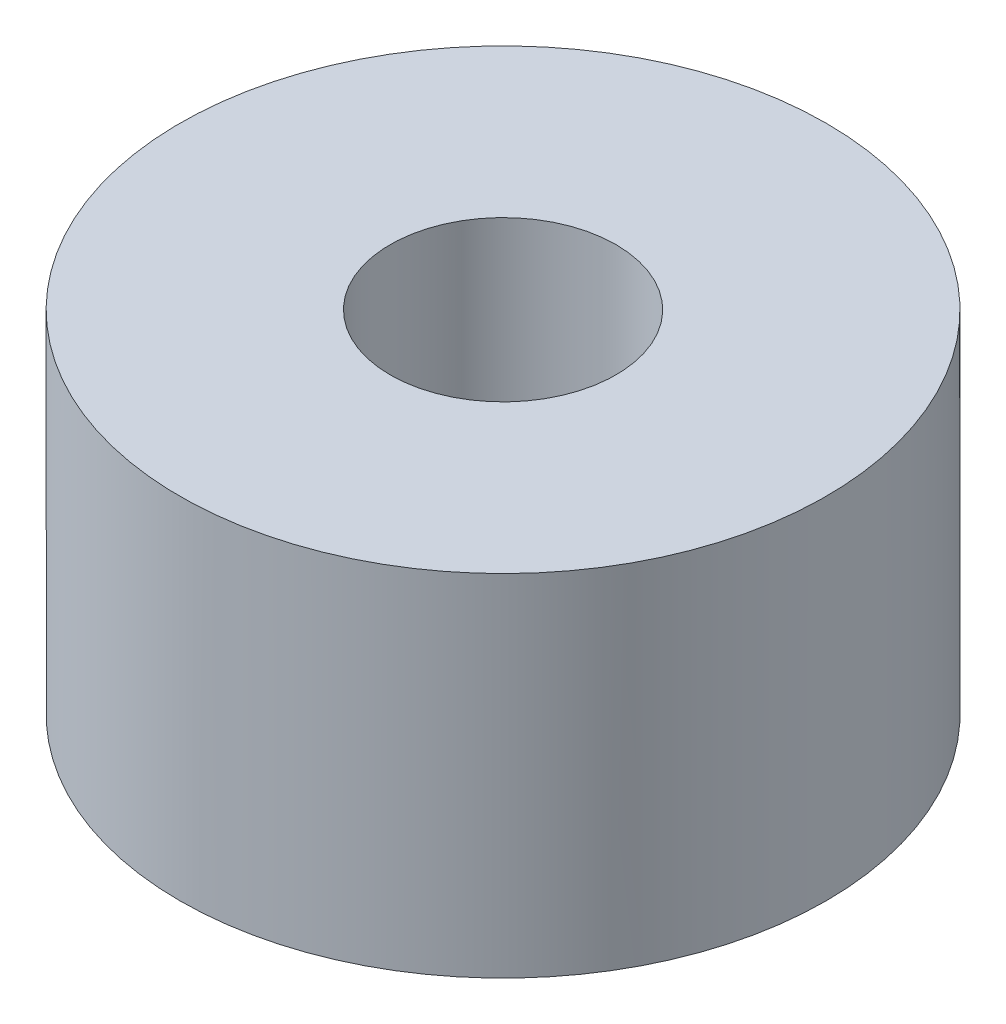
ISO-10303-21;
HEADER;
FILE_DESCRIPTION(('STEP AP214'),'2;1');
FILE_NAME('part.step','',(''),(''),'','','');
FILE_SCHEMA(('AUTOMOTIVE_DESIGN { 1 0 10303 214 1 1 1 1 }'));
ENDSEC;
DATA;
#1=APPLICATION_CONTEXT('core data for automotive mechanical design processes');
#2=APPLICATION_PROTOCOL_DEFINITION('international standard','automotive_design',2000,#1);
#3=PRODUCT_CONTEXT('',#1,'mechanical');
#4=PRODUCT('Part','Part','',(#3));
#5=PRODUCT_RELATED_PRODUCT_CATEGORY('part','',(#4));
#6=PRODUCT_DEFINITION_FORMATION('','',#4);
#7=PRODUCT_DEFINITION_CONTEXT('part definition',#1,'design');
#8=PRODUCT_DEFINITION('design','',#6,#7);
#9=PRODUCT_DEFINITION_SHAPE('','',#8);
#10=(LENGTH_UNIT() NAMED_UNIT(*) SI_UNIT(.MILLI.,.METRE.));
#11=(NAMED_UNIT(*) PLANE_ANGLE_UNIT() SI_UNIT($,.RADIAN.));
#12=(NAMED_UNIT(*) SI_UNIT($,.STERADIAN.) SOLID_ANGLE_UNIT());
#13=UNCERTAINTY_MEASURE_WITH_UNIT(LENGTH_MEASURE(1.E-05),#10,'distance_accuracy_value','');
#14=(GEOMETRIC_REPRESENTATION_CONTEXT(3) GLOBAL_UNCERTAINTY_ASSIGNED_CONTEXT((#13)) GLOBAL_UNIT_ASSIGNED_CONTEXT((#10,
#11,#12)) REPRESENTATION_CONTEXT('',''));
#15=CARTESIAN_POINT('',(0.,0.,0.));
#16=DIRECTION('',(0.,0.,1.));
#17=DIRECTION('',(1.,0.,0.));
#18=AXIS2_PLACEMENT_3D('',#15,#16,#17);
#19=CARTESIAN_POINT('',(71.8116756219717,-39.4518121125616,-2.1471785483412));
#20=DIRECTION('',(0.,1.,0.));
#21=DIRECTION('',(0.,0.,1.));
#22=AXIS2_PLACEMENT_3D('',#19,#20,#21);
#23=PLANE('',#22);
#24=CARTESIAN_POINT('',(71.8116756219717,-39.4518121125616,-2.1471785483412));
#25=DIRECTION('',(0.,1.,0.));
#26=DIRECTION('',(0.,0.,1.));
#27=AXIS2_PLACEMENT_3D('',#24,#25,#26);
#28=CIRCLE('',#27,4.14999999999992);
#29=CARTESIAN_POINT('',(71.8116756219717,-39.4518121125615,2.00282145165872));
#30=VERTEX_POINT('',#29);
#31=EDGE_CURVE('E43',#30,#30,#28,.T.);
#32=ORIENTED_EDGE('',*,*,#31,.F.);
#33=EDGE_LOOP('',(#32));
#34=FACE_BOUND('',#33,.T.);
#35=CARTESIAN_POINT('',(71.8116756219717,-39.4518121125616,-2.1471785483412));
#36=DIRECTION('',(0.,1.,0.));
#37=DIRECTION('',(0.,0.,1.));
#38=AXIS2_PLACEMENT_3D('',#35,#36,#37);
#39=CIRCLE('',#38,1.44999999999993);
#40=CARTESIAN_POINT('',(71.8116756219717,-39.4518121125615,-0.697178548341274));
#41=VERTEX_POINT('',#40);
#42=EDGE_CURVE('E52',#41,#41,#39,.T.);
#43=ORIENTED_EDGE('',*,*,#42,.T.);
#44=EDGE_LOOP('',(#43));
#45=FACE_BOUND('',#44,.T.);
#46=ADVANCED_FACE('F36',(#34,#45),#23,.F.);
#47=CARTESIAN_POINT('',(71.8116756219717,-23.1138395448651,-2.14717854834132));
#48=DIRECTION('',(0.,-1.,0.));
#49=DIRECTION('',(0.,0.,-1.));
#50=AXIS2_PLACEMENT_3D('',#47,#48,#49);
#51=CYLINDRICAL_SURFACE('',#50,4.14999999999992);
#52=CARTESIAN_POINT('',(71.8116756219717,-34.9518121125616,-2.14717854834123));
#53=DIRECTION('',(0.,-1.,0.));
#54=DIRECTION('',(0.,0.,-1.));
#55=AXIS2_PLACEMENT_3D('',#52,#53,#54);
#56=CIRCLE('',#55,4.14999999999992);
#57=CARTESIAN_POINT('',(71.8116756219717,-34.9518121125616,-6.29717854834116));
#58=VERTEX_POINT('',#57);
#59=EDGE_CURVE('E47',#58,#58,#56,.T.);
#60=ORIENTED_EDGE('',*,*,#59,.T.);
#61=EDGE_LOOP('',(#60));
#62=FACE_BOUND('',#61,.T.);
#63=ORIENTED_EDGE('',*,*,#31,.T.);
#64=EDGE_LOOP('',(#63));
#65=FACE_BOUND('',#64,.T.);
#66=ADVANCED_FACE('F60',(#62,#65),#51,.T.);
#67=CARTESIAN_POINT('',(71.8116756219717,-23.1138395448651,-2.14717854834132));
#68=DIRECTION('',(0.,-1.,0.));
#69=DIRECTION('',(0.,0.,-1.));
#70=AXIS2_PLACEMENT_3D('',#67,#68,#69);
#71=CYLINDRICAL_SURFACE('',#70,1.44999999999993);
#72=CARTESIAN_POINT('',(71.8116756219717,-34.9518121125616,-2.14717854834123));
#73=DIRECTION('',(0.,-1.,0.));
#74=DIRECTION('',(0.,0.,-1.));
#75=AXIS2_PLACEMENT_3D('',#72,#73,#74);
#76=CIRCLE('',#75,1.44999999999993);
#77=CARTESIAN_POINT('',(71.8116756219717,-34.9518121125616,-3.59717854834116));
#78=VERTEX_POINT('',#77);
#79=EDGE_CURVE('E11',#78,#78,#76,.T.);
#80=ORIENTED_EDGE('',*,*,#79,.F.);
#81=EDGE_LOOP('',(#80));
#82=FACE_BOUND('',#81,.T.);
#83=ORIENTED_EDGE('',*,*,#42,.F.);
#84=EDGE_LOOP('',(#83));
#85=FACE_BOUND('',#84,.T.);
#86=ADVANCED_FACE('F58',(#82,#85),#71,.F.);
#87=CARTESIAN_POINT('',(71.8116756219716,-34.9518121125616,-2.14717854834126));
#88=DIRECTION('',(0.,-1.,0.));
#89=DIRECTION('',(0.,0.,-1.));
#90=AXIS2_PLACEMENT_3D('',#87,#88,#89);
#91=PLANE('',#90);
#92=ORIENTED_EDGE('',*,*,#79,.T.);
#93=EDGE_LOOP('',(#92));
#94=FACE_BOUND('',#93,.T.);
#95=ORIENTED_EDGE('',*,*,#59,.F.);
#96=EDGE_LOOP('',(#95));
#97=FACE_BOUND('',#96,.T.);
#98=ADVANCED_FACE('F38',(#94,#97),#91,.F.);
#99=CLOSED_SHELL('',(#46,#66,#86,#98));
#100=MANIFOLD_SOLID_BREP('B2',#99);
#101=ADVANCED_BREP_SHAPE_REPRESENTATION('',(#18,#100),#14);
#102=SHAPE_DEFINITION_REPRESENTATION(#9,#101);
ENDSEC;
END-ISO-10303-21;
